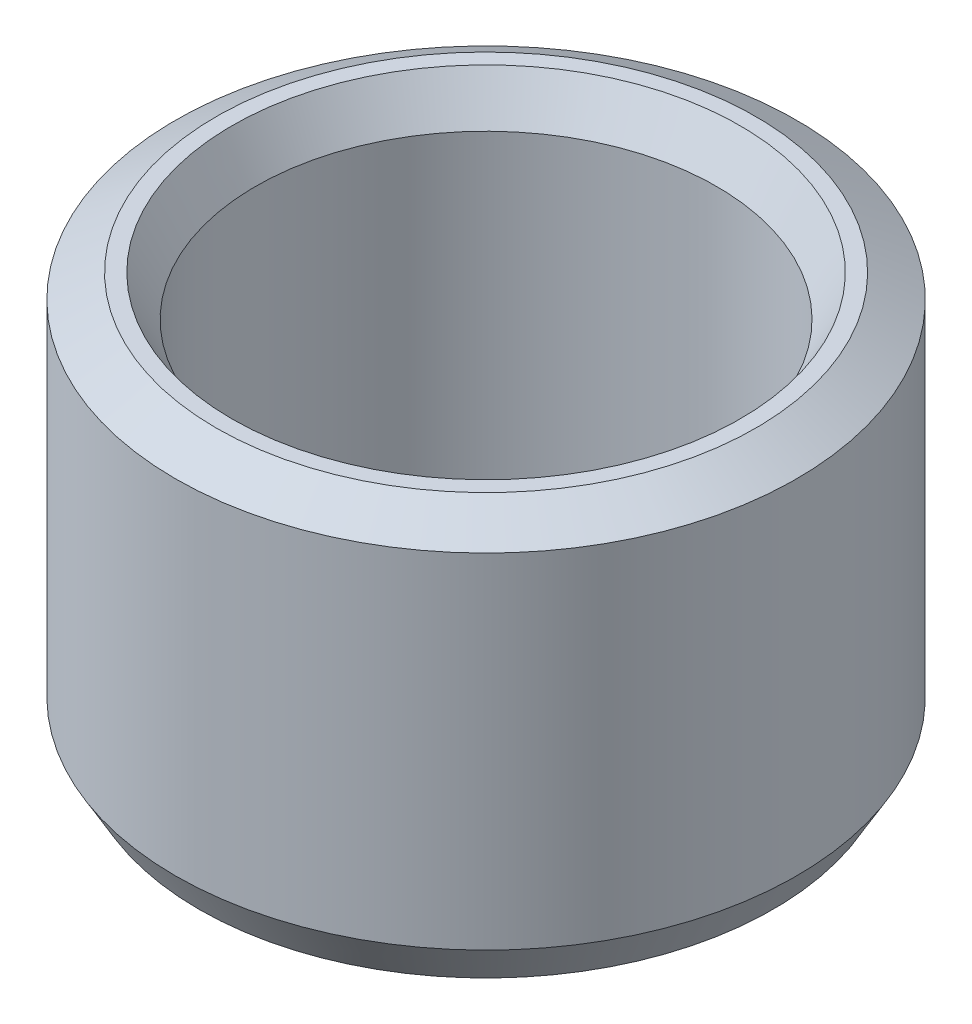
ISO-10303-21;
HEADER;
FILE_DESCRIPTION(('STEP AP214'),'2;1');
FILE_NAME('part.step','',(''),(''),'','','');
FILE_SCHEMA(('AUTOMOTIVE_DESIGN { 1 0 10303 214 1 1 1 1 }'));
ENDSEC;
DATA;
#1=APPLICATION_CONTEXT('core data for automotive mechanical design processes');
#2=APPLICATION_PROTOCOL_DEFINITION('international standard','automotive_design',2000,#1);
#3=PRODUCT_CONTEXT('',#1,'mechanical');
#4=PRODUCT('Part','Part','',(#3));
#5=PRODUCT_RELATED_PRODUCT_CATEGORY('part','',(#4));
#6=PRODUCT_DEFINITION_FORMATION('','',#4);
#7=PRODUCT_DEFINITION_CONTEXT('part definition',#1,'design');
#8=PRODUCT_DEFINITION('design','',#6,#7);
#9=PRODUCT_DEFINITION_SHAPE('','',#8);
#10=(LENGTH_UNIT() NAMED_UNIT(*) SI_UNIT(.MILLI.,.METRE.));
#11=(NAMED_UNIT(*) PLANE_ANGLE_UNIT() SI_UNIT($,.RADIAN.));
#12=(NAMED_UNIT(*) SI_UNIT($,.STERADIAN.) SOLID_ANGLE_UNIT());
#13=UNCERTAINTY_MEASURE_WITH_UNIT(LENGTH_MEASURE(1.E-05),#10,'distance_accuracy_value','');
#14=(GEOMETRIC_REPRESENTATION_CONTEXT(3) GLOBAL_UNCERTAINTY_ASSIGNED_CONTEXT((#13)) GLOBAL_UNIT_ASSIGNED_CONTEXT((#10,
#11,#12)) REPRESENTATION_CONTEXT('',''));
#15=CARTESIAN_POINT('',(0.,0.,0.));
#16=DIRECTION('',(0.,0.,1.));
#17=DIRECTION('',(1.,0.,0.));
#18=AXIS2_PLACEMENT_3D('',#15,#16,#17);
#19=CARTESIAN_POINT('',(0.,36.1430487433398,0.));
#20=DIRECTION('',(0.,-1.,0.));
#21=DIRECTION('',(0.,0.,-1.));
#22=AXIS2_PLACEMENT_3D('',#19,#20,#21);
#23=CYLINDRICAL_SURFACE('',#22,27.5);
#24=CARTESIAN_POINT('',(0.,3.61136776782564,0.));
#25=DIRECTION('',(0.,1.,0.));
#26=DIRECTION('',(0.,0.,1.));
#27=AXIS2_PLACEMENT_3D('',#24,#25,#26);
#28=CIRCLE('',#27,27.5);
#29=CARTESIAN_POINT('',(0.,3.61136776782564,27.5));
#30=VERTEX_POINT('',#29);
#31=EDGE_CURVE('E10',#30,#30,#28,.T.);
#32=ORIENTED_EDGE('',*,*,#31,.T.);
#33=EDGE_LOOP('',(#32));
#34=FACE_BOUND('',#33,.T.);
#35=CARTESIAN_POINT('',(0.,34.0580245904429,0.));
#36=DIRECTION('',(0.,1.,0.));
#37=DIRECTION('',(0.,0.,1.));
#38=AXIS2_PLACEMENT_3D('',#35,#36,#37);
#39=CIRCLE('',#38,27.5);
#40=CARTESIAN_POINT('',(0.,34.0580245904429,27.5));
#41=VERTEX_POINT('',#40);
#42=EDGE_CURVE('E50',#41,#41,#39,.F.);
#43=ORIENTED_EDGE('',*,*,#42,.T.);
#44=EDGE_LOOP('',(#43));
#45=FACE_BOUND('',#44,.T.);
#46=ADVANCED_FACE('F39',(#34,#45),#23,.T.);
#47=CARTESIAN_POINT('',(0.,36.1430487433398,0.));
#48=DIRECTION('',(0.,1.,0.));
#49=DIRECTION('',(0.,0.,1.));
#50=AXIS2_PLACEMENT_3D('',#47,#48,#49);
#51=PLANE('',#50);
#52=CARTESIAN_POINT('',(0.,36.1430487433398,0.));
#53=DIRECTION('',(0.,1.,0.));
#54=DIRECTION('',(0.,0.,1.));
#55=AXIS2_PLACEMENT_3D('',#52,#53,#54);
#56=CIRCLE('',#55,22.4941663634354);
#57=CARTESIAN_POINT('',(0.,36.1430487433398,22.4941663634354));
#58=VERTEX_POINT('',#57);
#59=EDGE_CURVE('E58',#58,#58,#56,.F.);
#60=ORIENTED_EDGE('',*,*,#59,.T.);
#61=EDGE_LOOP('',(#60));
#62=FACE_BOUND('',#61,.T.);
#63=CARTESIAN_POINT('',(0.,36.1430487433398,0.));
#64=DIRECTION('',(0.,1.,0.));
#65=DIRECTION('',(0.,0.,1.));
#66=AXIS2_PLACEMENT_3D('',#63,#64,#65);
#67=CIRCLE('',#66,23.8886322321744);
#68=CARTESIAN_POINT('',(0.,36.1430487433398,23.8886322321744));
#69=VERTEX_POINT('',#68);
#70=EDGE_CURVE('E61',#69,#69,#67,.T.);
#71=ORIENTED_EDGE('',*,*,#70,.T.);
#72=EDGE_LOOP('',(#71));
#73=FACE_BOUND('',#72,.T.);
#74=ADVANCED_FACE('F88',(#62,#73),#51,.T.);
#75=CARTESIAN_POINT('',(0.,0.,0.));
#76=DIRECTION('',(0.,1.,0.));
#77=DIRECTION('',(0.,0.,1.));
#78=AXIS2_PLACEMENT_3D('',#75,#76,#77);
#79=PLANE('',#78);
#80=CARTESIAN_POINT('',(0.,0.,0.));
#81=DIRECTION('',(0.,1.,0.));
#82=DIRECTION('',(0.,0.,1.));
#83=AXIS2_PLACEMENT_3D('',#80,#81,#82);
#84=CIRCLE('',#83,24.0205099783642);
#85=CARTESIAN_POINT('',(0.,0.,24.0205099783642));
#86=VERTEX_POINT('',#85);
#87=EDGE_CURVE('E51',#86,#86,#84,.T.);
#88=ORIENTED_EDGE('',*,*,#87,.T.);
#89=EDGE_LOOP('',(#88));
#90=FACE_BOUND('',#89,.T.);
#91=CARTESIAN_POINT('',(0.,0.,0.));
#92=DIRECTION('',(0.,1.,0.));
#93=DIRECTION('',(0.,0.,1.));
#94=AXIS2_PLACEMENT_3D('',#91,#92,#93);
#95=CIRCLE('',#94,25.4149758471031);
#96=CARTESIAN_POINT('',(0.,0.,25.4149758471031));
#97=VERTEX_POINT('',#96);
#98=EDGE_CURVE('E54',#97,#97,#95,.F.);
#99=ORIENTED_EDGE('',*,*,#98,.T.);
#100=EDGE_LOOP('',(#99));
#101=FACE_BOUND('',#100,.T.);
#102=ADVANCED_FACE('F83',(#90,#101),#79,.F.);
#103=CARTESIAN_POINT('',(0.,36.1430487433398,0.));
#104=DIRECTION('',(0.,-1.,0.));
#105=DIRECTION('',(0.,0.,-1.));
#106=AXIS2_PLACEMENT_3D('',#103,#104,#105);
#107=CYLINDRICAL_SURFACE('',#106,20.4091422105385);
#108=CARTESIAN_POINT('',(0.,32.5316809755141,0.));
#109=DIRECTION('',(0.,1.,0.));
#110=DIRECTION('',(0.,0.,1.));
#111=AXIS2_PLACEMENT_3D('',#108,#109,#110);
#112=CIRCLE('',#111,20.4091422105385);
#113=CARTESIAN_POINT('',(0.,32.5316809755141,20.4091422105385));
#114=VERTEX_POINT('',#113);
#115=EDGE_CURVE('E67',#114,#114,#112,.T.);
#116=ORIENTED_EDGE('',*,*,#115,.T.);
#117=EDGE_LOOP('',(#116));
#118=FACE_BOUND('',#117,.T.);
#119=CARTESIAN_POINT('',(0.,2.08502415289689,0.));
#120=DIRECTION('',(0.,1.,0.));
#121=DIRECTION('',(0.,0.,1.));
#122=AXIS2_PLACEMENT_3D('',#119,#120,#121);
#123=CIRCLE('',#122,20.4091422105385);
#124=CARTESIAN_POINT('',(0.,2.08502415289689,20.4091422105385));
#125=VERTEX_POINT('',#124);
#126=EDGE_CURVE('E69',#125,#125,#123,.F.);
#127=ORIENTED_EDGE('',*,*,#126,.T.);
#128=EDGE_LOOP('',(#127));
#129=FACE_BOUND('',#128,.T.);
#130=ADVANCED_FACE('F71',(#118,#129),#107,.F.);
#131=CARTESIAN_POINT('',(0.,32.5316809755141,0.));
#132=DIRECTION('',(0.,1.,0.));
#133=DIRECTION('',(0.,0.,1.));
#134=AXIS2_PLACEMENT_3D('',#131,#132,#133);
#135=CONICAL_SURFACE('',#134,20.4091422105385,0.523598775598302);
#136=CARTESIAN_POINT('',(0.,36.1430487433398,22.4941663634354));
#137=CARTESIAN_POINT('',(0.,36.1054303290916,22.4724473618428));
#138=CARTESIAN_POINT('',(0.,36.0678119148434,22.4507283602501));
#139=CARTESIAN_POINT('',(0.,35.992575086347,22.4072903570647));
#140=CARTESIAN_POINT('',(0.,35.9549566720988,22.385571355472));
#141=CARTESIAN_POINT('',(0.,35.8797198436025,22.3421333522867));
#142=CARTESIAN_POINT('',(0.,35.8421014293543,22.320414350694));
#143=CARTESIAN_POINT('',(0.,35.7668646008579,22.2769763475087));
#144=CARTESIAN_POINT('',(0.,35.7292461866097,22.255257345916));
#145=CARTESIAN_POINT('',(0.,35.6540093581134,22.2118193427306));
#146=CARTESIAN_POINT('',(0.,35.6163909438652,22.190100341138));
#147=CARTESIAN_POINT('',(0.,35.5411541153688,22.1466623379526));
#148=CARTESIAN_POINT('',(0.,35.5035357011206,22.1249433363599));
#149=CARTESIAN_POINT('',(0.,35.4282988726243,22.0815053331746));
#150=CARTESIAN_POINT('',(0.,35.3906804583761,22.0597863315819));
#151=CARTESIAN_POINT('',(0.,35.3154436298797,22.0163483283966));
#152=CARTESIAN_POINT('',(0.,35.2778252156315,21.9946293268039));
#153=CARTESIAN_POINT('',(0.,35.2025883871352,21.9511913236185));
#154=CARTESIAN_POINT('',(0.,35.164969972887,21.9294723220259));
#155=CARTESIAN_POINT('',(0.,35.0897331443906,21.8860343188405));
#156=CARTESIAN_POINT('',(0.,35.0521147301424,21.8643153172478));
#157=CARTESIAN_POINT('',(0.,34.9768779016461,21.8208773140625));
#158=CARTESIAN_POINT('',(0.,34.9392594873979,21.7991583124698));
#159=CARTESIAN_POINT('',(0.,34.8640226589015,21.7557203092844));
#160=CARTESIAN_POINT('',(0.,34.8264042446533,21.7340013076918));
#161=CARTESIAN_POINT('',(0.,34.751167416157,21.6905633045064));
#162=CARTESIAN_POINT('',(0.,34.7135490019088,21.6688443029137));
#163=CARTESIAN_POINT('',(0.,34.6383121734124,21.6254062997284));
#164=CARTESIAN_POINT('',(0.,34.6006937591642,21.6036872981357));
#165=CARTESIAN_POINT('',(0.,34.5254569306679,21.5602492949504));
#166=CARTESIAN_POINT('',(0.,34.4878385164197,21.5385302933577));
#167=CARTESIAN_POINT('',(0.,34.4126016879233,21.4950922901723));
#168=CARTESIAN_POINT('',(0.,34.3749832736751,21.4733732885797));
#169=CARTESIAN_POINT('',(0.,34.2997464451788,21.4299352853943));
#170=CARTESIAN_POINT('',(0.,34.2621280309306,21.4082162838016));
#171=CARTESIAN_POINT('',(0.,34.1868912024342,21.3647782806163));
#172=CARTESIAN_POINT('',(0.,34.149272788186,21.3430592790236));
#173=CARTESIAN_POINT('',(0.,34.0740359596897,21.2996212758383));
#174=CARTESIAN_POINT('',(0.,34.0364175454415,21.2779022742456));
#175=CARTESIAN_POINT('',(0.,33.9611807169451,21.2344642710602));
#176=CARTESIAN_POINT('',(0.,33.9235623026969,21.2127452694676));
#177=CARTESIAN_POINT('',(0.,33.8483254742005,21.1693072662822));
#178=CARTESIAN_POINT('',(0.,33.8107070599524,21.1475882646895));
#179=CARTESIAN_POINT('',(0.,33.735470231456,21.1041502615042));
#180=CARTESIAN_POINT('',(0.,33.6978518172078,21.0824312599115));
#181=CARTESIAN_POINT('',(0.,33.6226149887115,21.0389932567261));
#182=CARTESIAN_POINT('',(0.,33.5849965744633,21.0172742551335));
#183=CARTESIAN_POINT('',(0.,33.5097597459669,20.9738362519481));
#184=CARTESIAN_POINT('',(0.,33.4721413317187,20.9521172503554));
#185=CARTESIAN_POINT('',(0.,33.3969045032224,20.9086792471701));
#186=CARTESIAN_POINT('',(0.,33.3592860889742,20.8869602455774));
#187=CARTESIAN_POINT('',(0.,33.2840492604778,20.8435222423921));
#188=CARTESIAN_POINT('',(0.,33.2464308462296,20.8218032407994));
#189=CARTESIAN_POINT('',(0.,33.1711940177332,20.778365237614));
#190=CARTESIAN_POINT('',(0.,33.1335756034851,20.7566462360214));
#191=CARTESIAN_POINT('',(0.,33.0583387749887,20.713208232836));
#192=CARTESIAN_POINT('',(0.,33.0207203607405,20.6914892312433));
#193=CARTESIAN_POINT('',(0.,32.9454835322441,20.648051228058));
#194=CARTESIAN_POINT('',(0.,32.907865117996,20.6263322264653));
#195=CARTESIAN_POINT('',(0.,32.8326282894996,20.58289422328));
#196=CARTESIAN_POINT('',(0.,32.7950098752514,20.5611752216873));
#197=CARTESIAN_POINT('',(0.,32.719773046755,20.5177372185019));
#198=CARTESIAN_POINT('',(0.,32.6821546325069,20.4960182169092));
#199=CARTESIAN_POINT('',(0.,32.6069178040105,20.4525802137239));
#200=CARTESIAN_POINT('',(0.,32.5692993897623,20.4308612121312));
#201=CARTESIAN_POINT('',(0.,32.5316809755141,20.4091422105385));
#202=B_SPLINE_CURVE_WITH_KNOTS('',3,(#136,#137,#138,#139,#140,#141,#142,#143,#144,#145,#146,
#147,#148,#149,#150,#151,#152,#153,#154,#155,#156,#157,#158,#159,#160,#161,#162,#163,#164,#165,
#166,#167,#168,#169,#170,#171,#172,#173,#174,#175,#176,#177,#178,#179,#180,#181,#182,#183,#184,
#185,#186,#187,#188,#189,#190,#191,#192,#193,#194,#195,#196,#197,#198,#199,#200,#201),
.UNSPECIFIED.,.F.,.F.,(4,2,2,2,2,2,2,2,2,2,2,2,2,2,2,2,2,2,2,2,2,2,2,2,2,2,2,2,2,2,2,2,4),(0.,
0.130314009556051,0.260628019112104,0.390942028668163,0.521256038224215,0.651570047780268,
0.781884057336325,0.912198066892378,1.04251207644843,1.17282608600449,1.30314009556054,
1.43345410511659,1.56376811467265,1.6940821242287,1.82439613378476,1.95471014334081,
2.08502415289687,2.21533816245292,2.34565217200898,2.47596618156503,2.60628019112108,
2.73659420067714,2.8669082102332,2.99722221978925,3.12753622934531,3.25785023890136,
3.38816424845741,3.51847825801347,3.64879226756952,3.77910627712558,3.90942028668163,
4.03973429623769,4.17004830579374),.UNSPECIFIED.);
#203=EDGE_CURVE('BSEAM77',#58,#114,#202,.T.);
#204=ORIENTED_EDGE('',*,*,#59,.F.);
#205=ORIENTED_EDGE('',*,*,#115,.F.);
#206=ORIENTED_EDGE('',*,*,#203,.T.);
#207=ORIENTED_EDGE('',*,*,#203,.F.);
#208=EDGE_LOOP('',(#204,#206,#205,#207));
#209=FACE_BOUND('',#208,.T.);
#210=ADVANCED_FACE('F77',(#209),#135,.F.);
#211=CARTESIAN_POINT('',(0.,0.,0.));
#212=DIRECTION('',(0.,-1.,0.));
#213=DIRECTION('',(0.,0.,-1.));
#214=AXIS2_PLACEMENT_3D('',#211,#212,#213);
#215=CONICAL_SURFACE('',#214,24.0205099783642,1.04719755119659);
#216=ORIENTED_EDGE('',*,*,#126,.F.);
#217=EDGE_LOOP('',(#216));
#218=FACE_BOUND('',#217,.T.);
#219=ORIENTED_EDGE('',*,*,#87,.F.);
#220=EDGE_LOOP('',(#219));
#221=FACE_BOUND('',#220,.T.);
#222=ADVANCED_FACE('F73',(#218,#221),#215,.F.);
#223=CARTESIAN_POINT('',(0.,3.61136776782564,0.));
#224=DIRECTION('',(0.,1.,0.));
#225=DIRECTION('',(0.,0.,1.));
#226=AXIS2_PLACEMENT_3D('',#223,#224,#225);
#227=CONICAL_SURFACE('',#226,27.5,0.523598775598301);
#228=ORIENTED_EDGE('',*,*,#98,.F.);
#229=EDGE_LOOP('',(#228));
#230=FACE_BOUND('',#229,.T.);
#231=ORIENTED_EDGE('',*,*,#31,.F.);
#232=EDGE_LOOP('',(#231));
#233=FACE_BOUND('',#232,.T.);
#234=ADVANCED_FACE('F76',(#230,#233),#227,.T.);
#235=CARTESIAN_POINT('',(0.,36.1430487433398,0.));
#236=DIRECTION('',(0.,-1.,0.));
#237=DIRECTION('',(0.,0.,-1.));
#238=AXIS2_PLACEMENT_3D('',#235,#236,#237);
#239=CONICAL_SURFACE('',#238,23.8886322321744,1.0471975511966);
#240=ORIENTED_EDGE('',*,*,#42,.F.);
#241=EDGE_LOOP('',(#240));
#242=FACE_BOUND('',#241,.T.);
#243=ORIENTED_EDGE('',*,*,#70,.F.);
#244=EDGE_LOOP('',(#243));
#245=FACE_BOUND('',#244,.T.);
#246=ADVANCED_FACE('F45',(#242,#245),#239,.T.);
#247=CLOSED_SHELL('',(#46,#74,#102,#130,#210,#222,#234,#246));
#248=MANIFOLD_SOLID_BREP('B2',#247);
#249=ADVANCED_BREP_SHAPE_REPRESENTATION('',(#18,#248),#14);
#250=SHAPE_DEFINITION_REPRESENTATION(#9,#249);
ENDSEC;
END-ISO-10303-21;
